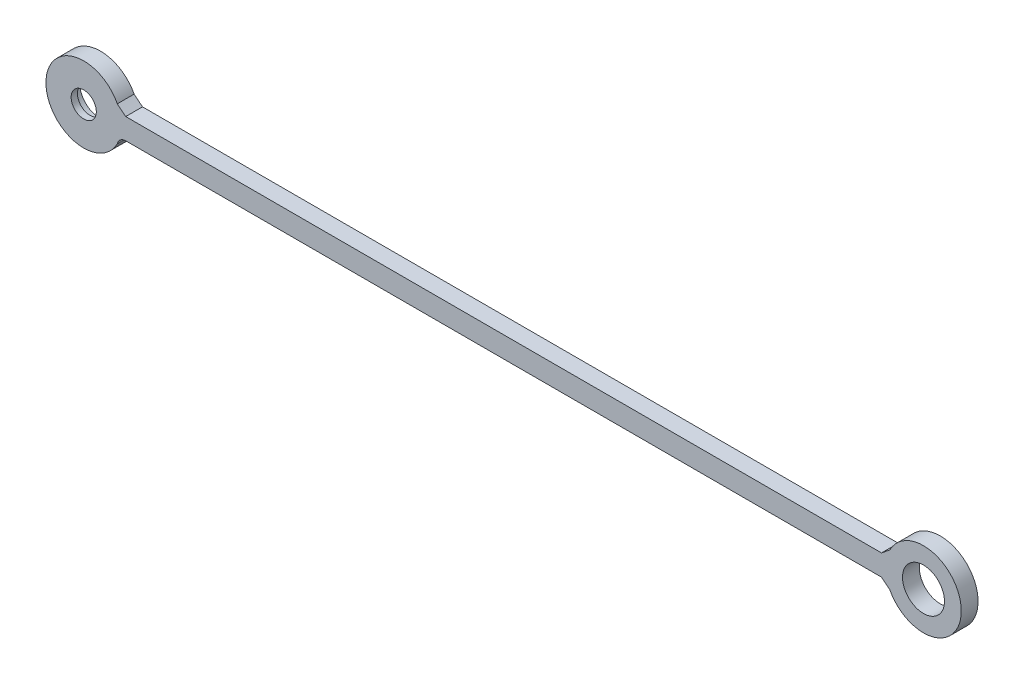
ISO-10303-21;
HEADER;
FILE_DESCRIPTION(('STEP AP214'),'2;1');
FILE_NAME('part.step','',(''),(''),'','','');
FILE_SCHEMA(('AUTOMOTIVE_DESIGN { 1 0 10303 214 1 1 1 1 }'));
ENDSEC;
DATA;
#1=APPLICATION_CONTEXT('core data for automotive mechanical design processes');
#2=APPLICATION_PROTOCOL_DEFINITION('international standard','automotive_design',2000,#1);
#3=PRODUCT_CONTEXT('',#1,'mechanical');
#4=PRODUCT('Part','Part','',(#3));
#5=PRODUCT_RELATED_PRODUCT_CATEGORY('part','',(#4));
#6=PRODUCT_DEFINITION_FORMATION('','',#4);
#7=PRODUCT_DEFINITION_CONTEXT('part definition',#1,'design');
#8=PRODUCT_DEFINITION('design','',#6,#7);
#9=PRODUCT_DEFINITION_SHAPE('','',#8);
#10=(LENGTH_UNIT() NAMED_UNIT(*) SI_UNIT(.MILLI.,.METRE.));
#11=(NAMED_UNIT(*) PLANE_ANGLE_UNIT() SI_UNIT($,.RADIAN.));
#12=(NAMED_UNIT(*) SI_UNIT($,.STERADIAN.) SOLID_ANGLE_UNIT());
#13=UNCERTAINTY_MEASURE_WITH_UNIT(LENGTH_MEASURE(1.E-05),#10,'distance_accuracy_value','');
#14=(GEOMETRIC_REPRESENTATION_CONTEXT(3) GLOBAL_UNCERTAINTY_ASSIGNED_CONTEXT((#13)) GLOBAL_UNIT_ASSIGNED_CONTEXT((#10,
#11,#12)) REPRESENTATION_CONTEXT('',''));
#15=CARTESIAN_POINT('',(0.,0.,0.));
#16=DIRECTION('',(0.,0.,1.));
#17=DIRECTION('',(1.,0.,0.));
#18=AXIS2_PLACEMENT_3D('',#15,#16,#17);
#19=CARTESIAN_POINT('',(-105.,0.83175131787061,4.));
#20=DIRECTION('',(0.,0.,1.));
#21=DIRECTION('',(1.,0.,0.));
#22=AXIS2_PLACEMENT_3D('',#19,#20,#21);
#23=PLANE('',#22);
#24=CARTESIAN_POINT('',(95.,0.83175131787061,4.));
#25=DIRECTION('',(0.,0.,1.));
#26=DIRECTION('',(1.,0.,0.));
#27=AXIS2_PLACEMENT_3D('',#24,#25,#26);
#28=CIRCLE('',#27,5.);
#29=CARTESIAN_POINT('',(100.,0.83175131787061,4.));
#30=VERTEX_POINT('',#29);
#31=EDGE_CURVE('E193',#30,#30,#28,.T.);
#32=ORIENTED_EDGE('',*,*,#31,.F.);
#33=EDGE_LOOP('',(#32));
#34=FACE_BOUND('',#33,.T.);
#35=CARTESIAN_POINT('',(-105.,0.83175131787061,4.));
#36=DIRECTION('',(0.,0.,1.));
#37=DIRECTION('',(1.,0.,0.));
#38=AXIS2_PLACEMENT_3D('',#35,#36,#37);
#39=CIRCLE('',#38,9.);
#40=CARTESIAN_POINT('',(-97.,4.95485694348827,4.));
#41=VERTEX_POINT('',#40);
#42=CARTESIAN_POINT('',(-97.,-3.29135430774709,4.));
#43=VERTEX_POINT('',#42);
#44=EDGE_CURVE('E146',#41,#43,#39,.T.);
#45=ORIENTED_EDGE('',*,*,#44,.T.);
#46=CARTESIAN_POINT('',(-95.,-3.71200719272756,4.));
#47=DIRECTION('',(0.,0.,1.));
#48=DIRECTION('',(1.,0.,0.));
#49=AXIS2_PLACEMENT_3D('',#46,#47,#48);
#50=CIRCLE('',#49,2.04375851059817);
#51=CARTESIAN_POINT('',(-95.,-1.66824868212939,4.));
#52=VERTEX_POINT('',#51);
#53=EDGE_CURVE('E237',#52,#43,#50,.T.);
#54=ORIENTED_EDGE('',*,*,#53,.F.);
#55=DIRECTION('',(1.,0.,0.));
#56=VECTOR('',#55,1.);
#57=CARTESIAN_POINT('',(-95.,-1.66824868212939,4.));
#58=LINE('',#57,#56);
#59=CARTESIAN_POINT('',(85.,-1.66824868212939,4.));
#60=VERTEX_POINT('',#59);
#61=EDGE_CURVE('E227',#52,#60,#58,.T.);
#62=ORIENTED_EDGE('',*,*,#61,.T.);
#63=DIRECTION('',(0.776473819420305,-0.630149512222967,0.));
#64=VECTOR('',#63,1.);
#65=CARTESIAN_POINT('',(85.,-1.66824868212939,4.));
#66=LINE('',#65,#64);
#67=CARTESIAN_POINT('',(87.,-3.29135430774703,4.));
#68=VERTEX_POINT('',#67);
#69=EDGE_CURVE('E184',#60,#68,#66,.T.);
#70=ORIENTED_EDGE('',*,*,#69,.T.);
#71=CARTESIAN_POINT('',(95.,0.83175131787061,4.));
#72=DIRECTION('',(0.,0.,1.));
#73=DIRECTION('',(1.,0.,0.));
#74=AXIS2_PLACEMENT_3D('',#71,#72,#73);
#75=CIRCLE('',#74,9.);
#76=CARTESIAN_POINT('',(87.,4.95485694348824,4.));
#77=VERTEX_POINT('',#76);
#78=EDGE_CURVE('E181',#68,#77,#75,.T.);
#79=ORIENTED_EDGE('',*,*,#78,.T.);
#80=CARTESIAN_POINT('',(13.9035908365129,92.9809102920782,4.));
#81=DIRECTION('',(0.,0.,1.));
#82=DIRECTION('',(1.,0.,0.));
#83=AXIS2_PLACEMENT_3D('',#80,#81,#82);
#84=CIRCLE('',#83,114.418840672001);
#85=CARTESIAN_POINT('',(85.,3.33175131787061,4.));
#86=VERTEX_POINT('',#85);
#87=EDGE_CURVE('E167',#86,#77,#84,.T.);
#88=ORIENTED_EDGE('',*,*,#87,.F.);
#89=DIRECTION('',(-1.,0.,0.));
#90=VECTOR('',#89,1.);
#91=CARTESIAN_POINT('',(85.,3.33175131787061,4.));
#92=LINE('',#91,#90);
#93=CARTESIAN_POINT('',(-95.,3.33175131787058,4.));
#94=VERTEX_POINT('',#93);
#95=EDGE_CURVE('E174',#86,#94,#92,.T.);
#96=ORIENTED_EDGE('',*,*,#95,.T.);
#97=CARTESIAN_POINT('',(-54.4504031567716,55.3409541017538,4.));
#98=DIRECTION('',(0.,0.,1.));
#99=DIRECTION('',(1.,0.,0.));
#100=AXIS2_PLACEMENT_3D('',#97,#98,#99);
#101=CIRCLE('',#100,65.9486692690871);
#102=EDGE_CURVE('E177',#41,#94,#101,.T.);
#103=ORIENTED_EDGE('',*,*,#102,.F.);
#104=EDGE_LOOP('',(#45,#54,#62,#70,#79,#88,#96,#103));
#105=FACE_BOUND('',#104,.T.);
#106=CARTESIAN_POINT('',(-105.,0.83175131787061,4.));
#107=DIRECTION('',(0.,0.,1.));
#108=DIRECTION('',(1.,0.,0.));
#109=AXIS2_PLACEMENT_3D('',#106,#107,#108);
#110=CIRCLE('',#109,3.00000000000011);
#111=CARTESIAN_POINT('',(-102.,0.83175131787061,4.));
#112=VERTEX_POINT('',#111);
#113=EDGE_CURVE('E281',#112,#112,#110,.T.);
#114=ORIENTED_EDGE('',*,*,#113,.F.);
#115=EDGE_LOOP('',(#114));
#116=FACE_BOUND('',#115,.T.);
#117=ADVANCED_FACE('F90',(#34,#105,#116),#23,.T.);
#118=CARTESIAN_POINT('',(-105.,0.83175131787061,0.));
#119=DIRECTION('',(0.,0.,1.));
#120=DIRECTION('',(1.,0.,0.));
#121=AXIS2_PLACEMENT_3D('',#118,#119,#120);
#122=PLANE('',#121);
#123=CARTESIAN_POINT('',(-105.,0.83175131787061,0.));
#124=DIRECTION('',(0.,0.,1.));
#125=DIRECTION('',(1.,0.,0.));
#126=AXIS2_PLACEMENT_3D('',#123,#124,#125);
#127=CIRCLE('',#126,5.00000000000002);
#128=CARTESIAN_POINT('',(-100.,0.83175131787061,0.));
#129=VERTEX_POINT('',#128);
#130=EDGE_CURVE('E278',#129,#129,#127,.T.);
#131=ORIENTED_EDGE('',*,*,#130,.T.);
#132=EDGE_LOOP('',(#131));
#133=FACE_BOUND('',#132,.T.);
#134=CARTESIAN_POINT('',(-105.,0.83175131787061,0.));
#135=DIRECTION('',(0.,0.,1.));
#136=DIRECTION('',(1.,0.,0.));
#137=AXIS2_PLACEMENT_3D('',#134,#135,#136);
#138=CIRCLE('',#137,9.);
#139=CARTESIAN_POINT('',(-97.,4.95485694348827,0.));
#140=VERTEX_POINT('',#139);
#141=CARTESIAN_POINT('',(-97.,-3.29135430774709,0.));
#142=VERTEX_POINT('',#141);
#143=EDGE_CURVE('E189',#140,#142,#138,.T.);
#144=ORIENTED_EDGE('',*,*,#143,.F.);
#145=CARTESIAN_POINT('',(-54.4504031567716,55.3409541017538,0.));
#146=DIRECTION('',(0.,0.,1.));
#147=DIRECTION('',(1.,0.,0.));
#148=AXIS2_PLACEMENT_3D('',#145,#146,#147);
#149=CIRCLE('',#148,65.9486692690871);
#150=CARTESIAN_POINT('',(-95.,3.33175131787058,0.));
#151=VERTEX_POINT('',#150);
#152=EDGE_CURVE('E208',#140,#151,#149,.T.);
#153=ORIENTED_EDGE('',*,*,#152,.T.);
#154=DIRECTION('',(-1.,0.,0.));
#155=VECTOR('',#154,1.);
#156=CARTESIAN_POINT('',(85.,3.33175131787061,0.));
#157=LINE('',#156,#155);
#158=CARTESIAN_POINT('',(85.,3.33175131787061,0.));
#159=VERTEX_POINT('',#158);
#160=EDGE_CURVE('E205',#159,#151,#157,.T.);
#161=ORIENTED_EDGE('',*,*,#160,.F.);
#162=CARTESIAN_POINT('',(13.9035908365129,92.9809102920782,0.));
#163=DIRECTION('',(0.,0.,1.));
#164=DIRECTION('',(1.,0.,0.));
#165=AXIS2_PLACEMENT_3D('',#162,#163,#164);
#166=CIRCLE('',#165,114.418840672001);
#167=CARTESIAN_POINT('',(87.,4.95485694348824,0.));
#168=VERTEX_POINT('',#167);
#169=EDGE_CURVE('E169',#159,#168,#166,.T.);
#170=ORIENTED_EDGE('',*,*,#169,.T.);
#171=CARTESIAN_POINT('',(95.,0.83175131787061,0.));
#172=DIRECTION('',(0.,0.,1.));
#173=DIRECTION('',(1.,0.,0.));
#174=AXIS2_PLACEMENT_3D('',#171,#172,#173);
#175=CIRCLE('',#174,9.);
#176=CARTESIAN_POINT('',(87.,-3.29135430774703,0.));
#177=VERTEX_POINT('',#176);
#178=EDGE_CURVE('E201',#177,#168,#175,.T.);
#179=ORIENTED_EDGE('',*,*,#178,.F.);
#180=DIRECTION('',(0.776473819420305,-0.630149512222967,0.));
#181=VECTOR('',#180,1.);
#182=CARTESIAN_POINT('',(85.,-1.66824868212939,0.));
#183=LINE('',#182,#181);
#184=CARTESIAN_POINT('',(85.,-1.66824868212939,0.));
#185=VERTEX_POINT('',#184);
#186=EDGE_CURVE('E199',#185,#177,#183,.T.);
#187=ORIENTED_EDGE('',*,*,#186,.F.);
#188=DIRECTION('',(1.,0.,0.));
#189=VECTOR('',#188,1.);
#190=CARTESIAN_POINT('',(-95.,-1.66824868212939,0.));
#191=LINE('',#190,#189);
#192=CARTESIAN_POINT('',(-95.,-1.66824868212939,0.));
#193=VERTEX_POINT('',#192);
#194=EDGE_CURVE('E196',#193,#185,#191,.T.);
#195=ORIENTED_EDGE('',*,*,#194,.F.);
#196=CARTESIAN_POINT('',(-95.,-3.71200719272756,0.));
#197=DIRECTION('',(0.,0.,1.));
#198=DIRECTION('',(1.,0.,0.));
#199=AXIS2_PLACEMENT_3D('',#196,#197,#198);
#200=CIRCLE('',#199,2.04375851059817);
#201=EDGE_CURVE('E192',#193,#142,#200,.T.);
#202=ORIENTED_EDGE('',*,*,#201,.T.);
#203=EDGE_LOOP('',(#144,#153,#161,#170,#179,#187,#195,#202));
#204=FACE_BOUND('',#203,.T.);
#205=CARTESIAN_POINT('',(95.,0.83175131787061,0.));
#206=DIRECTION('',(0.,0.,1.));
#207=DIRECTION('',(1.,0.,0.));
#208=AXIS2_PLACEMENT_3D('',#205,#206,#207);
#209=CIRCLE('',#208,5.);
#210=CARTESIAN_POINT('',(100.,0.83175131787061,0.));
#211=VERTEX_POINT('',#210);
#212=EDGE_CURVE('E288',#211,#211,#209,.T.);
#213=ORIENTED_EDGE('',*,*,#212,.T.);
#214=EDGE_LOOP('',(#213));
#215=FACE_BOUND('',#214,.T.);
#216=ADVANCED_FACE('F233',(#133,#204,#215),#122,.F.);
#217=CARTESIAN_POINT('',(-105.,0.83175131787061,4.));
#218=DIRECTION('',(0.,0.,-1.));
#219=DIRECTION('',(-1.,0.,0.));
#220=AXIS2_PLACEMENT_3D('',#217,#218,#219);
#221=CYLINDRICAL_SURFACE('',#220,9.);
#222=ORIENTED_EDGE('',*,*,#143,.T.);
#223=DIRECTION('',(0.,0.,-1.));
#224=VECTOR('',#223,1.);
#225=CARTESIAN_POINT('',(-97.,-3.29135430774709,4.));
#226=LINE('',#225,#224);
#227=EDGE_CURVE('E12',#43,#142,#226,.T.);
#228=ORIENTED_EDGE('',*,*,#227,.F.);
#229=ORIENTED_EDGE('',*,*,#44,.F.);
#230=DIRECTION('',(0.,0.,-1.));
#231=VECTOR('',#230,1.);
#232=CARTESIAN_POINT('',(-97.,4.95485694348827,4.));
#233=LINE('',#232,#231);
#234=EDGE_CURVE('E108',#41,#140,#233,.T.);
#235=ORIENTED_EDGE('',*,*,#234,.T.);
#236=EDGE_LOOP('',(#222,#228,#229,#235));
#237=FACE_BOUND('',#236,.T.);
#238=ADVANCED_FACE('F92',(#237),#221,.T.);
#239=CARTESIAN_POINT('',(-95.,-3.71200719272756,4.));
#240=DIRECTION('',(0.,0.,-1.));
#241=DIRECTION('',(-1.,0.,0.));
#242=AXIS2_PLACEMENT_3D('',#239,#240,#241);
#243=CYLINDRICAL_SURFACE('',#242,2.04375851059817);
#244=ORIENTED_EDGE('',*,*,#201,.F.);
#245=DIRECTION('',(0.,0.,-1.));
#246=VECTOR('',#245,1.);
#247=CARTESIAN_POINT('',(-95.,-1.66824868212939,4.));
#248=LINE('',#247,#246);
#249=EDGE_CURVE('E100',#52,#193,#248,.T.);
#250=ORIENTED_EDGE('',*,*,#249,.F.);
#251=ORIENTED_EDGE('',*,*,#53,.T.);
#252=ORIENTED_EDGE('',*,*,#227,.T.);
#253=EDGE_LOOP('',(#244,#250,#251,#252));
#254=FACE_BOUND('',#253,.T.);
#255=ADVANCED_FACE('F236',(#254),#243,.F.);
#256=CARTESIAN_POINT('',(-95.,-1.66824868212939,4.));
#257=DIRECTION('',(0.,1.,0.));
#258=DIRECTION('',(0.,0.,1.));
#259=AXIS2_PLACEMENT_3D('',#256,#257,#258);
#260=PLANE('',#259);
#261=ORIENTED_EDGE('',*,*,#194,.T.);
#262=DIRECTION('',(0.,0.,-1.));
#263=VECTOR('',#262,1.);
#264=CARTESIAN_POINT('',(85.,-1.66824868212939,4.));
#265=LINE('',#264,#263);
#266=EDGE_CURVE('E219',#60,#185,#265,.T.);
#267=ORIENTED_EDGE('',*,*,#266,.F.);
#268=ORIENTED_EDGE('',*,*,#61,.F.);
#269=ORIENTED_EDGE('',*,*,#249,.T.);
#270=EDGE_LOOP('',(#261,#267,#268,#269));
#271=FACE_BOUND('',#270,.T.);
#272=ADVANCED_FACE('F225',(#271),#260,.F.);
#273=CARTESIAN_POINT('',(85.,-1.66824868212939,4.));
#274=DIRECTION('',(0.630149512222967,0.776473819420305,0.));
#275=DIRECTION('',(-0.776473819420305,0.630149512222967,0.));
#276=AXIS2_PLACEMENT_3D('',#273,#274,#275);
#277=PLANE('',#276);
#278=ORIENTED_EDGE('',*,*,#186,.T.);
#279=DIRECTION('',(0.,0.,-1.));
#280=VECTOR('',#279,1.);
#281=CARTESIAN_POINT('',(87.,-3.29135430774703,4.));
#282=LINE('',#281,#280);
#283=EDGE_CURVE('E215',#68,#177,#282,.T.);
#284=ORIENTED_EDGE('',*,*,#283,.F.);
#285=ORIENTED_EDGE('',*,*,#69,.F.);
#286=ORIENTED_EDGE('',*,*,#266,.T.);
#287=EDGE_LOOP('',(#278,#284,#285,#286));
#288=FACE_BOUND('',#287,.T.);
#289=ADVANCED_FACE('F304',(#288),#277,.F.);
#290=CARTESIAN_POINT('',(95.,0.83175131787061,4.));
#291=DIRECTION('',(0.,0.,-1.));
#292=DIRECTION('',(-1.,0.,0.));
#293=AXIS2_PLACEMENT_3D('',#290,#291,#292);
#294=CYLINDRICAL_SURFACE('',#293,9.);
#295=ORIENTED_EDGE('',*,*,#178,.T.);
#296=DIRECTION('',(0.,0.,-1.));
#297=VECTOR('',#296,1.);
#298=CARTESIAN_POINT('',(87.,4.95485694348824,4.));
#299=LINE('',#298,#297);
#300=EDGE_CURVE('E172',#77,#168,#299,.T.);
#301=ORIENTED_EDGE('',*,*,#300,.F.);
#302=ORIENTED_EDGE('',*,*,#78,.F.);
#303=ORIENTED_EDGE('',*,*,#283,.T.);
#304=EDGE_LOOP('',(#295,#301,#302,#303));
#305=FACE_BOUND('',#304,.T.);
#306=ADVANCED_FACE('F306',(#305),#294,.T.);
#307=CARTESIAN_POINT('',(13.9035908365129,92.9809102920782,4.));
#308=DIRECTION('',(0.,0.,-1.));
#309=DIRECTION('',(-1.,0.,0.));
#310=AXIS2_PLACEMENT_3D('',#307,#308,#309);
#311=CYLINDRICAL_SURFACE('',#310,114.418840672001);
#312=ORIENTED_EDGE('',*,*,#169,.F.);
#313=DIRECTION('',(0.,0.,-1.));
#314=VECTOR('',#313,1.);
#315=CARTESIAN_POINT('',(85.,3.33175131787061,4.));
#316=LINE('',#315,#314);
#317=EDGE_CURVE('E163',#86,#159,#316,.T.);
#318=ORIENTED_EDGE('',*,*,#317,.F.);
#319=ORIENTED_EDGE('',*,*,#87,.T.);
#320=ORIENTED_EDGE('',*,*,#300,.T.);
#321=EDGE_LOOP('',(#312,#318,#319,#320));
#322=FACE_BOUND('',#321,.T.);
#323=ADVANCED_FACE('F165',(#322),#311,.F.);
#324=CARTESIAN_POINT('',(85.,3.33175131787061,4.));
#325=DIRECTION('',(0.,-1.,0.));
#326=DIRECTION('',(1.,0.,0.));
#327=AXIS2_PLACEMENT_3D('',#324,#325,#326);
#328=PLANE('',#327);
#329=ORIENTED_EDGE('',*,*,#160,.T.);
#330=DIRECTION('',(0.,0.,-1.));
#331=VECTOR('',#330,1.);
#332=CARTESIAN_POINT('',(-95.,3.33175131787058,4.));
#333=LINE('',#332,#331);
#334=EDGE_CURVE('E134',#94,#151,#333,.T.);
#335=ORIENTED_EDGE('',*,*,#334,.F.);
#336=ORIENTED_EDGE('',*,*,#95,.F.);
#337=ORIENTED_EDGE('',*,*,#317,.T.);
#338=EDGE_LOOP('',(#329,#335,#336,#337));
#339=FACE_BOUND('',#338,.T.);
#340=ADVANCED_FACE('F175',(#339),#328,.F.);
#341=CARTESIAN_POINT('',(-54.4504031567716,55.3409541017538,4.));
#342=DIRECTION('',(0.,0.,-1.));
#343=DIRECTION('',(-1.,0.,0.));
#344=AXIS2_PLACEMENT_3D('',#341,#342,#343);
#345=CYLINDRICAL_SURFACE('',#344,65.9486692690871);
#346=ORIENTED_EDGE('',*,*,#152,.F.);
#347=ORIENTED_EDGE('',*,*,#234,.F.);
#348=ORIENTED_EDGE('',*,*,#102,.T.);
#349=ORIENTED_EDGE('',*,*,#334,.T.);
#350=EDGE_LOOP('',(#346,#347,#348,#349));
#351=FACE_BOUND('',#350,.T.);
#352=ADVANCED_FACE('F238',(#351),#345,.F.);
#353=CARTESIAN_POINT('',(95.,0.83175131787061,4.));
#354=DIRECTION('',(0.,0.,-1.));
#355=DIRECTION('',(-1.,0.,0.));
#356=AXIS2_PLACEMENT_3D('',#353,#354,#355);
#357=CYLINDRICAL_SURFACE('',#356,5.);
#358=ORIENTED_EDGE('',*,*,#31,.T.);
#359=EDGE_LOOP('',(#358));
#360=FACE_BOUND('',#359,.T.);
#361=ORIENTED_EDGE('',*,*,#212,.F.);
#362=EDGE_LOOP('',(#361));
#363=FACE_BOUND('',#362,.T.);
#364=ADVANCED_FACE('F240',(#360,#363),#357,.F.);
#365=CARTESIAN_POINT('',(-105.,0.83175131787061,4.));
#366=DIRECTION('',(0.,0.,-1.));
#367=DIRECTION('',(-1.,0.,0.));
#368=AXIS2_PLACEMENT_3D('',#365,#366,#367);
#369=CYLINDRICAL_SURFACE('',#368,3.00000000000011);
#370=CARTESIAN_POINT('',(-105.,0.83175131787061,2.5));
#371=DIRECTION('',(0.,0.,1.));
#372=DIRECTION('',(1.,0.,0.));
#373=AXIS2_PLACEMENT_3D('',#370,#371,#372);
#374=CIRCLE('',#373,3.00000000000011);
#375=CARTESIAN_POINT('',(-102.,0.83175131787061,2.5));
#376=VERTEX_POINT('',#375);
#377=EDGE_CURVE('E94',#376,#376,#374,.T.);
#378=ORIENTED_EDGE('',*,*,#377,.F.);
#379=EDGE_LOOP('',(#378));
#380=FACE_BOUND('',#379,.T.);
#381=ORIENTED_EDGE('',*,*,#113,.T.);
#382=EDGE_LOOP('',(#381));
#383=FACE_BOUND('',#382,.T.);
#384=ADVANCED_FACE('F246',(#380,#383),#369,.F.);
#385=CARTESIAN_POINT('',(-105.,0.83175131787061,2.5));
#386=DIRECTION('',(0.,0.,-1.));
#387=DIRECTION('',(-1.,0.,0.));
#388=AXIS2_PLACEMENT_3D('',#385,#386,#387);
#389=CYLINDRICAL_SURFACE('',#388,5.00000000000002);
#390=CARTESIAN_POINT('',(-105.,0.83175131787061,2.5));
#391=DIRECTION('',(0.,0.,1.));
#392=DIRECTION('',(1.,0.,0.));
#393=AXIS2_PLACEMENT_3D('',#390,#391,#392);
#394=CIRCLE('',#393,5.00000000000002);
#395=CARTESIAN_POINT('',(-100.,0.83175131787061,2.5));
#396=VERTEX_POINT('',#395);
#397=EDGE_CURVE('E277',#396,#396,#394,.T.);
#398=ORIENTED_EDGE('',*,*,#397,.T.);
#399=EDGE_LOOP('',(#398));
#400=FACE_BOUND('',#399,.T.);
#401=ORIENTED_EDGE('',*,*,#130,.F.);
#402=EDGE_LOOP('',(#401));
#403=FACE_BOUND('',#402,.T.);
#404=ADVANCED_FACE('F262',(#400,#403),#389,.F.);
#405=CARTESIAN_POINT('',(-105.,0.83175131787061,2.5));
#406=DIRECTION('',(0.,0.,1.));
#407=DIRECTION('',(1.,0.,0.));
#408=AXIS2_PLACEMENT_3D('',#405,#406,#407);
#409=PLANE('',#408);
#410=ORIENTED_EDGE('',*,*,#377,.T.);
#411=EDGE_LOOP('',(#410));
#412=FACE_BOUND('',#411,.T.);
#413=ORIENTED_EDGE('',*,*,#397,.F.);
#414=EDGE_LOOP('',(#413));
#415=FACE_BOUND('',#414,.T.);
#416=ADVANCED_FACE('F266',(#412,#415),#409,.F.);
#417=CLOSED_SHELL('',(#117,#216,#238,#255,#272,#289,#306,#323,#340,#352,#364,#384,#404,#416));
#418=MANIFOLD_SOLID_BREP('B2',#417);
#419=ADVANCED_BREP_SHAPE_REPRESENTATION('',(#18,#418),#14);
#420=SHAPE_DEFINITION_REPRESENTATION(#9,#419);
ENDSEC;
END-ISO-10303-21;
